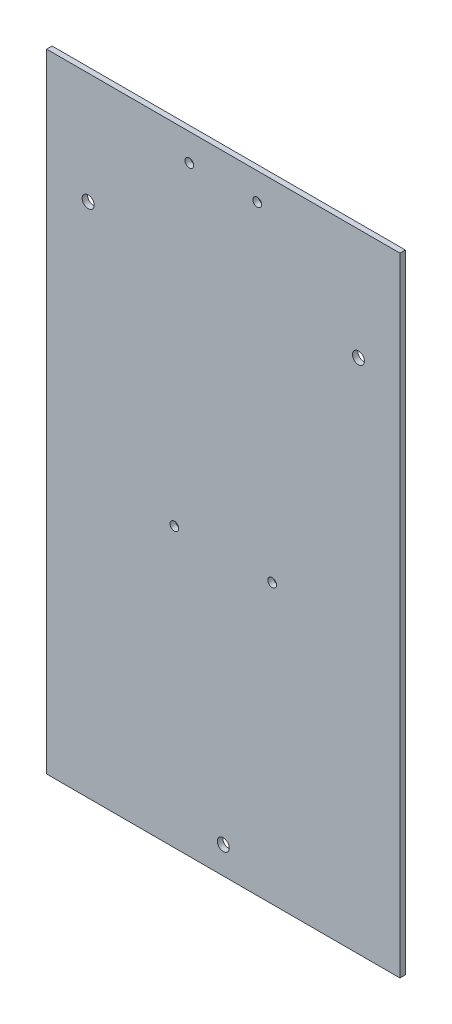
ISO-10303-21;
HEADER;
FILE_DESCRIPTION(('STEP AP214'),'2;1');
FILE_NAME('part.step','',(''),(''),'','','');
FILE_SCHEMA(('AUTOMOTIVE_DESIGN { 1 0 10303 214 1 1 1 1 }'));
ENDSEC;
DATA;
#1=APPLICATION_CONTEXT('core data for automotive mechanical design processes');
#2=APPLICATION_PROTOCOL_DEFINITION('international standard','automotive_design',2000,#1);
#3=PRODUCT_CONTEXT('',#1,'mechanical');
#4=PRODUCT('Part','Part','',(#3));
#5=PRODUCT_RELATED_PRODUCT_CATEGORY('part','',(#4));
#6=PRODUCT_DEFINITION_FORMATION('','',#4);
#7=PRODUCT_DEFINITION_CONTEXT('part definition',#1,'design');
#8=PRODUCT_DEFINITION('design','',#6,#7);
#9=PRODUCT_DEFINITION_SHAPE('','',#8);
#10=(LENGTH_UNIT() NAMED_UNIT(*) SI_UNIT(.MILLI.,.METRE.));
#11=(NAMED_UNIT(*) PLANE_ANGLE_UNIT() SI_UNIT($,.RADIAN.));
#12=(NAMED_UNIT(*) SI_UNIT($,.STERADIAN.) SOLID_ANGLE_UNIT());
#13=UNCERTAINTY_MEASURE_WITH_UNIT(LENGTH_MEASURE(1.E-05),#10,'distance_accuracy_value','');
#14=(GEOMETRIC_REPRESENTATION_CONTEXT(3) GLOBAL_UNCERTAINTY_ASSIGNED_CONTEXT((#13)) GLOBAL_UNIT_ASSIGNED_CONTEXT((#10,
#11,#12)) REPRESENTATION_CONTEXT('',''));
#15=CARTESIAN_POINT('',(0.,0.,0.));
#16=DIRECTION('',(0.,0.,1.));
#17=DIRECTION('',(1.,0.,0.));
#18=AXIS2_PLACEMENT_3D('',#15,#16,#17);
#19=CARTESIAN_POINT('',(-75.,115.5,2.));
#20=DIRECTION('',(0.,-1.,0.));
#21=DIRECTION('',(0.,0.,-1.));
#22=AXIS2_PLACEMENT_3D('',#19,#20,#21);
#23=PLANE('',#22);
#24=DIRECTION('',(0.,0.,1.));
#25=VECTOR('',#24,1.);
#26=CARTESIAN_POINT('',(65.,115.5,2.));
#27=LINE('',#26,#25);
#28=CARTESIAN_POINT('',(65.,115.5,0.));
#29=VERTEX_POINT('',#28);
#30=CARTESIAN_POINT('',(65.,115.5,2.));
#31=VERTEX_POINT('',#30);
#32=EDGE_CURVE('E83',#29,#31,#27,.T.);
#33=ORIENTED_EDGE('',*,*,#32,.F.);
#34=DIRECTION('',(-1.,0.,0.));
#35=VECTOR('',#34,1.);
#36=CARTESIAN_POINT('',(-75.,115.5,0.));
#37=LINE('',#36,#35);
#38=CARTESIAN_POINT('',(-65.,115.5,0.));
#39=VERTEX_POINT('',#38);
#40=EDGE_CURVE('E63',#29,#39,#37,.T.);
#41=ORIENTED_EDGE('',*,*,#40,.T.);
#42=DIRECTION('',(0.,0.,-1.));
#43=VECTOR('',#42,1.);
#44=CARTESIAN_POINT('',(-65.,115.5,0.));
#45=LINE('',#44,#43);
#46=CARTESIAN_POINT('',(-65.,115.5,2.));
#47=VERTEX_POINT('',#46);
#48=EDGE_CURVE('E105',#47,#39,#45,.T.);
#49=ORIENTED_EDGE('',*,*,#48,.F.);
#50=DIRECTION('',(-1.,0.,0.));
#51=VECTOR('',#50,1.);
#52=CARTESIAN_POINT('',(-75.,115.5,2.));
#53=LINE('',#52,#51);
#54=EDGE_CURVE('E47',#31,#47,#53,.T.);
#55=ORIENTED_EDGE('',*,*,#54,.F.);
#56=EDGE_LOOP('',(#33,#41,#49,#55));
#57=FACE_BOUND('',#56,.T.);
#58=ADVANCED_FACE('F38',(#57),#23,.F.);
#59=CARTESIAN_POINT('',(-75.,-115.5,2.));
#60=DIRECTION('',(0.,1.,0.));
#61=DIRECTION('',(0.,0.,1.));
#62=AXIS2_PLACEMENT_3D('',#59,#60,#61);
#63=PLANE('',#62);
#64=DIRECTION('',(0.,0.,-1.));
#65=VECTOR('',#64,1.);
#66=CARTESIAN_POINT('',(65.,-115.5,2.));
#67=LINE('',#66,#65);
#68=CARTESIAN_POINT('',(65.,-115.5,2.));
#69=VERTEX_POINT('',#68);
#70=CARTESIAN_POINT('',(65.,-115.5,0.));
#71=VERTEX_POINT('',#70);
#72=EDGE_CURVE('E55',#69,#71,#67,.T.);
#73=ORIENTED_EDGE('',*,*,#72,.F.);
#74=DIRECTION('',(1.,0.,0.));
#75=VECTOR('',#74,1.);
#76=CARTESIAN_POINT('',(-75.,-115.5,2.));
#77=LINE('',#76,#75);
#78=CARTESIAN_POINT('',(-65.,-115.5,2.));
#79=VERTEX_POINT('',#78);
#80=EDGE_CURVE('E11',#79,#69,#77,.T.);
#81=ORIENTED_EDGE('',*,*,#80,.F.);
#82=DIRECTION('',(0.,0.,1.));
#83=VECTOR('',#82,1.);
#84=CARTESIAN_POINT('',(-65.,-115.5,0.));
#85=LINE('',#84,#83);
#86=CARTESIAN_POINT('',(-65.,-115.5,0.));
#87=VERTEX_POINT('',#86);
#88=EDGE_CURVE('E106',#87,#79,#85,.T.);
#89=ORIENTED_EDGE('',*,*,#88,.F.);
#90=DIRECTION('',(1.,0.,0.));
#91=VECTOR('',#90,1.);
#92=CARTESIAN_POINT('',(-75.,-115.5,0.));
#93=LINE('',#92,#91);
#94=EDGE_CURVE('E95',#87,#71,#93,.T.);
#95=ORIENTED_EDGE('',*,*,#94,.T.);
#96=EDGE_LOOP('',(#73,#81,#89,#95));
#97=FACE_BOUND('',#96,.T.);
#98=ADVANCED_FACE('F92',(#97),#63,.F.);
#99=CARTESIAN_POINT('',(0.,0.,2.));
#100=DIRECTION('',(0.,0.,1.));
#101=DIRECTION('',(1.,0.,0.));
#102=AXIS2_PLACEMENT_3D('',#99,#100,#101);
#103=PLANE('',#102);
#104=CARTESIAN_POINT('',(12.5,105.5,2.));
#105=DIRECTION('',(0.,0.,1.));
#106=DIRECTION('',(1.,0.,0.));
#107=AXIS2_PLACEMENT_3D('',#104,#105,#106);
#108=CIRCLE('',#107,1.6);
#109=CARTESIAN_POINT('',(14.1,105.5,2.));
#110=VERTEX_POINT('',#109);
#111=EDGE_CURVE('E87',#110,#110,#108,.T.);
#112=ORIENTED_EDGE('',*,*,#111,.F.);
#113=EDGE_LOOP('',(#112));
#114=FACE_BOUND('',#113,.T.);
#115=CARTESIAN_POINT('',(-12.5,105.5,2.));
#116=DIRECTION('',(0.,0.,1.));
#117=DIRECTION('',(1.,0.,0.));
#118=AXIS2_PLACEMENT_3D('',#115,#116,#117);
#119=CIRCLE('',#118,1.6);
#120=CARTESIAN_POINT('',(-10.9,105.5,2.));
#121=VERTEX_POINT('',#120);
#122=EDGE_CURVE('E194',#121,#121,#119,.T.);
#123=ORIENTED_EDGE('',*,*,#122,.F.);
#124=EDGE_LOOP('',(#123));
#125=FACE_BOUND('',#124,.T.);
#126=CARTESIAN_POINT('',(-18.,-13.,2.));
#127=DIRECTION('',(0.,0.,1.));
#128=DIRECTION('',(1.,0.,0.));
#129=AXIS2_PLACEMENT_3D('',#126,#127,#128);
#130=CIRCLE('',#129,1.6);
#131=CARTESIAN_POINT('',(-16.4,-13.,2.));
#132=VERTEX_POINT('',#131);
#133=EDGE_CURVE('E116',#132,#132,#130,.T.);
#134=ORIENTED_EDGE('',*,*,#133,.F.);
#135=EDGE_LOOP('',(#134));
#136=FACE_BOUND('',#135,.T.);
#137=CARTESIAN_POINT('',(18.,-13.,2.));
#138=DIRECTION('',(0.,0.,1.));
#139=DIRECTION('',(1.,0.,0.));
#140=AXIS2_PLACEMENT_3D('',#137,#138,#139);
#141=CIRCLE('',#140,1.6);
#142=CARTESIAN_POINT('',(19.6,-13.,2.));
#143=VERTEX_POINT('',#142);
#144=EDGE_CURVE('E110',#143,#143,#141,.T.);
#145=ORIENTED_EDGE('',*,*,#144,.F.);
#146=EDGE_LOOP('',(#145));
#147=FACE_BOUND('',#146,.T.);
#148=CARTESIAN_POINT('',(49.73,74.5,2.));
#149=DIRECTION('',(0.,0.,1.));
#150=DIRECTION('',(1.,0.,0.));
#151=AXIS2_PLACEMENT_3D('',#148,#149,#150);
#152=CIRCLE('',#151,2.2);
#153=CARTESIAN_POINT('',(51.93,74.5,2.));
#154=VERTEX_POINT('',#153);
#155=EDGE_CURVE('E128',#154,#154,#152,.T.);
#156=ORIENTED_EDGE('',*,*,#155,.F.);
#157=EDGE_LOOP('',(#156));
#158=FACE_BOUND('',#157,.T.);
#159=CARTESIAN_POINT('',(-49.73,74.5000000000001,2.));
#160=DIRECTION('',(0.,0.,1.));
#161=DIRECTION('',(1.,0.,0.));
#162=AXIS2_PLACEMENT_3D('',#159,#160,#161);
#163=CIRCLE('',#162,2.2);
#164=CARTESIAN_POINT('',(-47.53,74.5000000000001,2.));
#165=VERTEX_POINT('',#164);
#166=EDGE_CURVE('E136',#165,#165,#163,.T.);
#167=ORIENTED_EDGE('',*,*,#166,.F.);
#168=EDGE_LOOP('',(#167));
#169=FACE_BOUND('',#168,.T.);
#170=CARTESIAN_POINT('',(0.,-105.5,2.));
#171=DIRECTION('',(0.,0.,1.));
#172=DIRECTION('',(1.,0.,0.));
#173=AXIS2_PLACEMENT_3D('',#170,#171,#172);
#174=CIRCLE('',#173,2.19999999999999);
#175=CARTESIAN_POINT('',(2.20000000000002,-105.5,2.));
#176=VERTEX_POINT('',#175);
#177=EDGE_CURVE('E144',#176,#176,#174,.T.);
#178=ORIENTED_EDGE('',*,*,#177,.F.);
#179=EDGE_LOOP('',(#178));
#180=FACE_BOUND('',#179,.T.);
#181=ORIENTED_EDGE('',*,*,#80,.T.);
#182=DIRECTION('',(0.,-1.,0.));
#183=VECTOR('',#182,1.);
#184=CARTESIAN_POINT('',(65.,115.5,2.));
#185=LINE('',#184,#183);
#186=EDGE_CURVE('E81',#31,#69,#185,.T.);
#187=ORIENTED_EDGE('',*,*,#186,.F.);
#188=ORIENTED_EDGE('',*,*,#54,.T.);
#189=DIRECTION('',(0.,1.,0.));
#190=VECTOR('',#189,1.);
#191=CARTESIAN_POINT('',(-65.,-115.5,2.));
#192=LINE('',#191,#190);
#193=EDGE_CURVE('E102',#79,#47,#192,.T.);
#194=ORIENTED_EDGE('',*,*,#193,.F.);
#195=EDGE_LOOP('',(#181,#187,#188,#194));
#196=FACE_BOUND('',#195,.T.);
#197=ADVANCED_FACE('F100',(#114,#125,#136,#147,#158,#169,#180,#196),#103,.T.);
#198=CARTESIAN_POINT('',(0.,0.,0.));
#199=DIRECTION('',(0.,0.,1.));
#200=DIRECTION('',(1.,0.,0.));
#201=AXIS2_PLACEMENT_3D('',#198,#199,#200);
#202=PLANE('',#201);
#203=CARTESIAN_POINT('',(12.5,105.5,0.));
#204=DIRECTION('',(0.,0.,-1.));
#205=DIRECTION('',(0.,1.,0.));
#206=AXIS2_PLACEMENT_3D('',#203,#204,#205);
#207=CIRCLE('',#206,1.6);
#208=CARTESIAN_POINT('',(12.5,107.1,0.));
#209=VERTEX_POINT('',#208);
#210=EDGE_CURVE('E198',#209,#209,#207,.T.);
#211=ORIENTED_EDGE('',*,*,#210,.F.);
#212=EDGE_LOOP('',(#211));
#213=FACE_BOUND('',#212,.T.);
#214=CARTESIAN_POINT('',(-12.5,105.5,0.));
#215=DIRECTION('',(0.,0.,-1.));
#216=DIRECTION('',(0.,1.,0.));
#217=AXIS2_PLACEMENT_3D('',#214,#215,#216);
#218=CIRCLE('',#217,1.6);
#219=CARTESIAN_POINT('',(-12.5,107.1,0.));
#220=VERTEX_POINT('',#219);
#221=EDGE_CURVE('E199',#220,#220,#218,.T.);
#222=ORIENTED_EDGE('',*,*,#221,.F.);
#223=EDGE_LOOP('',(#222));
#224=FACE_BOUND('',#223,.T.);
#225=CARTESIAN_POINT('',(0.,-105.5,0.));
#226=DIRECTION('',(0.,0.,1.));
#227=DIRECTION('',(1.,0.,0.));
#228=AXIS2_PLACEMENT_3D('',#225,#226,#227);
#229=CIRCLE('',#228,2.19999999999999);
#230=CARTESIAN_POINT('',(2.20000000000002,-105.5,0.));
#231=VERTEX_POINT('',#230);
#232=EDGE_CURVE('E140',#231,#231,#229,.T.);
#233=ORIENTED_EDGE('',*,*,#232,.T.);
#234=EDGE_LOOP('',(#233));
#235=FACE_BOUND('',#234,.T.);
#236=CARTESIAN_POINT('',(-49.73,74.5000000000001,0.));
#237=DIRECTION('',(0.,0.,1.));
#238=DIRECTION('',(1.,0.,0.));
#239=AXIS2_PLACEMENT_3D('',#236,#237,#238);
#240=CIRCLE('',#239,2.2);
#241=CARTESIAN_POINT('',(-47.53,74.5000000000001,0.));
#242=VERTEX_POINT('',#241);
#243=EDGE_CURVE('E132',#242,#242,#240,.T.);
#244=ORIENTED_EDGE('',*,*,#243,.T.);
#245=EDGE_LOOP('',(#244));
#246=FACE_BOUND('',#245,.T.);
#247=CARTESIAN_POINT('',(49.73,74.5,0.));
#248=DIRECTION('',(0.,0.,1.));
#249=DIRECTION('',(1.,0.,0.));
#250=AXIS2_PLACEMENT_3D('',#247,#248,#249);
#251=CIRCLE('',#250,2.2);
#252=CARTESIAN_POINT('',(51.93,74.5,0.));
#253=VERTEX_POINT('',#252);
#254=EDGE_CURVE('E124',#253,#253,#251,.T.);
#255=ORIENTED_EDGE('',*,*,#254,.T.);
#256=EDGE_LOOP('',(#255));
#257=FACE_BOUND('',#256,.T.);
#258=CARTESIAN_POINT('',(18.,-13.,0.));
#259=DIRECTION('',(0.,0.,1.));
#260=DIRECTION('',(1.,0.,0.));
#261=AXIS2_PLACEMENT_3D('',#258,#259,#260);
#262=CIRCLE('',#261,1.6);
#263=CARTESIAN_POINT('',(19.6,-13.,0.));
#264=VERTEX_POINT('',#263);
#265=EDGE_CURVE('E120',#264,#264,#262,.T.);
#266=ORIENTED_EDGE('',*,*,#265,.T.);
#267=EDGE_LOOP('',(#266));
#268=FACE_BOUND('',#267,.T.);
#269=CARTESIAN_POINT('',(-18.,-13.,0.));
#270=DIRECTION('',(0.,0.,1.));
#271=DIRECTION('',(1.,0.,0.));
#272=AXIS2_PLACEMENT_3D('',#269,#270,#271);
#273=CIRCLE('',#272,1.6);
#274=CARTESIAN_POINT('',(-16.4,-13.,0.));
#275=VERTEX_POINT('',#274);
#276=EDGE_CURVE('E41',#275,#275,#273,.T.);
#277=ORIENTED_EDGE('',*,*,#276,.T.);
#278=EDGE_LOOP('',(#277));
#279=FACE_BOUND('',#278,.T.);
#280=DIRECTION('',(0.,1.,0.));
#281=VECTOR('',#280,1.);
#282=CARTESIAN_POINT('',(65.,115.5,0.));
#283=LINE('',#282,#281);
#284=EDGE_CURVE('E97',#71,#29,#283,.T.);
#285=ORIENTED_EDGE('',*,*,#284,.F.);
#286=ORIENTED_EDGE('',*,*,#94,.F.);
#287=DIRECTION('',(0.,-1.,0.));
#288=VECTOR('',#287,1.);
#289=CARTESIAN_POINT('',(-65.,-115.5,0.));
#290=LINE('',#289,#288);
#291=EDGE_CURVE('E112',#39,#87,#290,.T.);
#292=ORIENTED_EDGE('',*,*,#291,.F.);
#293=ORIENTED_EDGE('',*,*,#40,.F.);
#294=EDGE_LOOP('',(#285,#286,#292,#293));
#295=FACE_BOUND('',#294,.T.);
#296=ADVANCED_FACE('F161',(#213,#224,#235,#246,#257,#268,#279,#295),#202,.F.);
#297=CARTESIAN_POINT('',(0.,-105.5,0.));
#298=DIRECTION('',(0.,0.,1.));
#299=DIRECTION('',(1.,0.,0.));
#300=AXIS2_PLACEMENT_3D('',#297,#298,#299);
#301=CYLINDRICAL_SURFACE('',#300,2.19999999999999);
#302=ORIENTED_EDGE('',*,*,#232,.F.);
#303=EDGE_LOOP('',(#302));
#304=FACE_BOUND('',#303,.T.);
#305=ORIENTED_EDGE('',*,*,#177,.T.);
#306=EDGE_LOOP('',(#305));
#307=FACE_BOUND('',#306,.T.);
#308=ADVANCED_FACE('F211',(#304,#307),#301,.F.);
#309=CARTESIAN_POINT('',(-49.73,74.5000000000001,0.));
#310=DIRECTION('',(0.,0.,1.));
#311=DIRECTION('',(1.,0.,0.));
#312=AXIS2_PLACEMENT_3D('',#309,#310,#311);
#313=CYLINDRICAL_SURFACE('',#312,2.2);
#314=ORIENTED_EDGE('',*,*,#243,.F.);
#315=EDGE_LOOP('',(#314));
#316=FACE_BOUND('',#315,.T.);
#317=ORIENTED_EDGE('',*,*,#166,.T.);
#318=EDGE_LOOP('',(#317));
#319=FACE_BOUND('',#318,.T.);
#320=ADVANCED_FACE('F223',(#316,#319),#313,.F.);
#321=CARTESIAN_POINT('',(49.73,74.5,0.));
#322=DIRECTION('',(0.,0.,1.));
#323=DIRECTION('',(1.,0.,0.));
#324=AXIS2_PLACEMENT_3D('',#321,#322,#323);
#325=CYLINDRICAL_SURFACE('',#324,2.2);
#326=ORIENTED_EDGE('',*,*,#254,.F.);
#327=EDGE_LOOP('',(#326));
#328=FACE_BOUND('',#327,.T.);
#329=ORIENTED_EDGE('',*,*,#155,.T.);
#330=EDGE_LOOP('',(#329));
#331=FACE_BOUND('',#330,.T.);
#332=ADVANCED_FACE('F176',(#328,#331),#325,.F.);
#333=CARTESIAN_POINT('',(18.,-13.,-8.));
#334=DIRECTION('',(0.,0.,1.));
#335=DIRECTION('',(1.,0.,0.));
#336=AXIS2_PLACEMENT_3D('',#333,#334,#335);
#337=CYLINDRICAL_SURFACE('',#336,1.6);
#338=ORIENTED_EDGE('',*,*,#144,.T.);
#339=EDGE_LOOP('',(#338));
#340=FACE_BOUND('',#339,.T.);
#341=ORIENTED_EDGE('',*,*,#265,.F.);
#342=EDGE_LOOP('',(#341));
#343=FACE_BOUND('',#342,.T.);
#344=ADVANCED_FACE('F167',(#340,#343),#337,.F.);
#345=CARTESIAN_POINT('',(-18.,-13.,-8.));
#346=DIRECTION('',(0.,0.,1.));
#347=DIRECTION('',(1.,0.,0.));
#348=AXIS2_PLACEMENT_3D('',#345,#346,#347);
#349=CYLINDRICAL_SURFACE('',#348,1.6);
#350=ORIENTED_EDGE('',*,*,#133,.T.);
#351=EDGE_LOOP('',(#350));
#352=FACE_BOUND('',#351,.T.);
#353=ORIENTED_EDGE('',*,*,#276,.F.);
#354=EDGE_LOOP('',(#353));
#355=FACE_BOUND('',#354,.T.);
#356=ADVANCED_FACE('F164',(#352,#355),#349,.F.);
#357=CARTESIAN_POINT('',(-65.,0.,0.));
#358=DIRECTION('',(1.,0.,0.));
#359=DIRECTION('',(0.,1.,0.));
#360=AXIS2_PLACEMENT_3D('',#357,#358,#359);
#361=PLANE('',#360);
#362=ORIENTED_EDGE('',*,*,#291,.T.);
#363=ORIENTED_EDGE('',*,*,#88,.T.);
#364=ORIENTED_EDGE('',*,*,#193,.T.);
#365=ORIENTED_EDGE('',*,*,#48,.T.);
#366=EDGE_LOOP('',(#362,#363,#364,#365));
#367=FACE_BOUND('',#366,.T.);
#368=ADVANCED_FACE('F166',(#367),#361,.F.);
#369=CARTESIAN_POINT('',(65.,0.,0.));
#370=DIRECTION('',(1.,0.,0.));
#371=DIRECTION('',(0.,1.,0.));
#372=AXIS2_PLACEMENT_3D('',#369,#370,#371);
#373=PLANE('',#372);
#374=ORIENTED_EDGE('',*,*,#186,.T.);
#375=ORIENTED_EDGE('',*,*,#72,.T.);
#376=ORIENTED_EDGE('',*,*,#284,.T.);
#377=ORIENTED_EDGE('',*,*,#32,.T.);
#378=EDGE_LOOP('',(#374,#375,#376,#377));
#379=FACE_BOUND('',#378,.T.);
#380=ADVANCED_FACE('F82',(#379),#373,.T.);
#381=CARTESIAN_POINT('',(-12.5,105.5,10.));
#382=DIRECTION('',(0.,0.,-1.));
#383=DIRECTION('',(0.,1.,0.));
#384=AXIS2_PLACEMENT_3D('',#381,#382,#383);
#385=CYLINDRICAL_SURFACE('',#384,1.6);
#386=ORIENTED_EDGE('',*,*,#122,.T.);
#387=EDGE_LOOP('',(#386));
#388=FACE_BOUND('',#387,.T.);
#389=ORIENTED_EDGE('',*,*,#221,.T.);
#390=EDGE_LOOP('',(#389));
#391=FACE_BOUND('',#390,.T.);
#392=ADVANCED_FACE('F275',(#388,#391),#385,.F.);
#393=CARTESIAN_POINT('',(12.5,105.5,10.));
#394=DIRECTION('',(0.,0.,-1.));
#395=DIRECTION('',(0.,1.,0.));
#396=AXIS2_PLACEMENT_3D('',#393,#394,#395);
#397=CYLINDRICAL_SURFACE('',#396,1.6);
#398=ORIENTED_EDGE('',*,*,#111,.T.);
#399=EDGE_LOOP('',(#398));
#400=FACE_BOUND('',#399,.T.);
#401=ORIENTED_EDGE('',*,*,#210,.T.);
#402=EDGE_LOOP('',(#401));
#403=FACE_BOUND('',#402,.T.);
#404=ADVANCED_FACE('F207',(#400,#403),#397,.F.);
#405=CLOSED_SHELL('',(#58,#98,#197,#296,#308,#320,#332,#344,#356,#368,#380,#392,#404));
#406=MANIFOLD_SOLID_BREP('B2',#405);
#407=ADVANCED_BREP_SHAPE_REPRESENTATION('',(#18,#406),#14);
#408=SHAPE_DEFINITION_REPRESENTATION(#9,#407);
ENDSEC;
END-ISO-10303-21;
